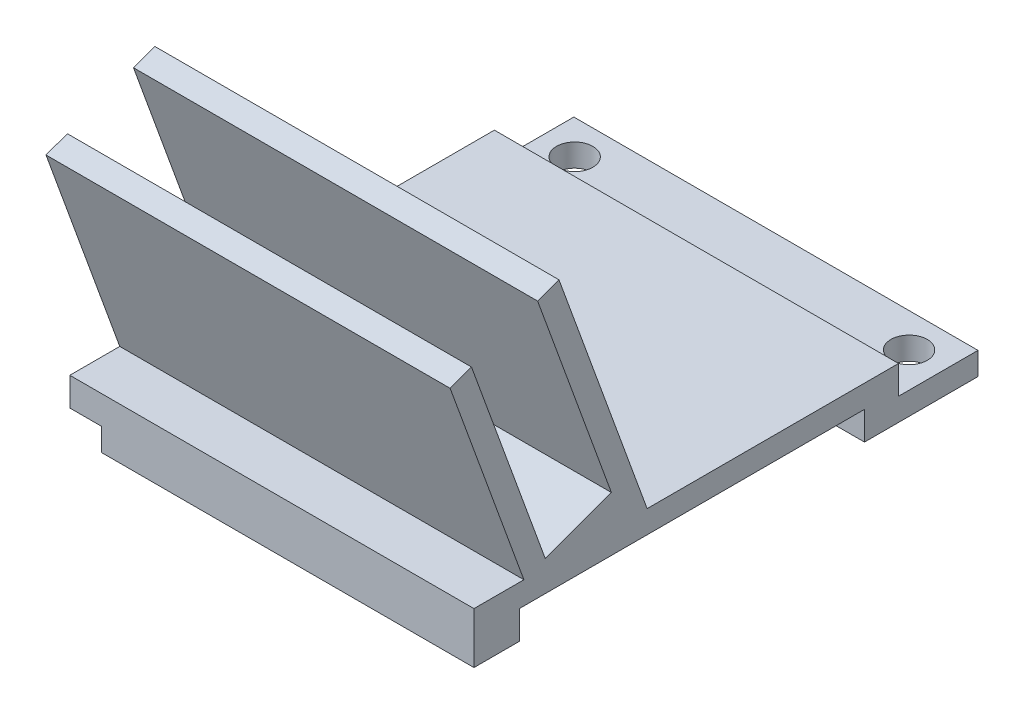
ISO-10303-21;
HEADER;
FILE_DESCRIPTION(('STEP AP214'),'2;1');
FILE_NAME('part.step','',(''),(''),'','','');
FILE_SCHEMA(('AUTOMOTIVE_DESIGN { 1 0 10303 214 1 1 1 1 }'));
ENDSEC;
DATA;
#1=APPLICATION_CONTEXT('core data for automotive mechanical design processes');
#2=APPLICATION_PROTOCOL_DEFINITION('international standard','automotive_design',2000,#1);
#3=PRODUCT_CONTEXT('',#1,'mechanical');
#4=PRODUCT('Part','Part','',(#3));
#5=PRODUCT_RELATED_PRODUCT_CATEGORY('part','',(#4));
#6=PRODUCT_DEFINITION_FORMATION('','',#4);
#7=PRODUCT_DEFINITION_CONTEXT('part definition',#1,'design');
#8=PRODUCT_DEFINITION('design','',#6,#7);
#9=PRODUCT_DEFINITION_SHAPE('','',#8);
#10=(LENGTH_UNIT() NAMED_UNIT(*) SI_UNIT(.MILLI.,.METRE.));
#11=(NAMED_UNIT(*) PLANE_ANGLE_UNIT() SI_UNIT($,.RADIAN.));
#12=(NAMED_UNIT(*) SI_UNIT($,.STERADIAN.) SOLID_ANGLE_UNIT());
#13=UNCERTAINTY_MEASURE_WITH_UNIT(LENGTH_MEASURE(1.E-05),#10,'distance_accuracy_value','');
#14=(GEOMETRIC_REPRESENTATION_CONTEXT(3) GLOBAL_UNCERTAINTY_ASSIGNED_CONTEXT((#13)) GLOBAL_UNIT_ASSIGNED_CONTEXT((#10,
#11,#12)) REPRESENTATION_CONTEXT('',''));
#15=CARTESIAN_POINT('',(0.,0.,0.));
#16=DIRECTION('',(0.,0.,1.));
#17=DIRECTION('',(1.,0.,0.));
#18=AXIS2_PLACEMENT_3D('',#15,#16,#17);
#19=CARTESIAN_POINT('',(17.8,2.,-3.));
#20=DIRECTION('',(-1.,0.,0.));
#21=DIRECTION('',(0.,0.,1.));
#22=AXIS2_PLACEMENT_3D('',#19,#20,#21);
#23=PLANE('',#22);
#24=DIRECTION('',(0.,1.,0.));
#25=VECTOR('',#24,1.);
#26=CARTESIAN_POINT('',(17.8,2.,37.4));
#27=LINE('',#26,#25);
#28=CARTESIAN_POINT('',(17.8,0.,37.4));
#29=VERTEX_POINT('',#28);
#30=CARTESIAN_POINT('',(17.8,2.5,37.4));
#31=VERTEX_POINT('',#30);
#32=EDGE_CURVE('E273',#29,#31,#27,.T.);
#33=ORIENTED_EDGE('',*,*,#32,.T.);
#34=DIRECTION('',(0.,0.,-1.));
#35=VECTOR('',#34,1.);
#36=CARTESIAN_POINT('',(17.8,2.5,37.));
#37=LINE('',#36,#35);
#38=CARTESIAN_POINT('',(17.8,2.5,7.));
#39=VERTEX_POINT('',#38);
#40=EDGE_CURVE('E291',#31,#39,#37,.T.);
#41=ORIENTED_EDGE('',*,*,#40,.T.);
#42=DIRECTION('',(0.,-1.,0.));
#43=VECTOR('',#42,1.);
#44=CARTESIAN_POINT('',(17.8,2.,7.));
#45=LINE('',#44,#43);
#46=CARTESIAN_POINT('',(17.8,0.,7.));
#47=VERTEX_POINT('',#46);
#48=EDGE_CURVE('E289',#39,#47,#45,.T.);
#49=ORIENTED_EDGE('',*,*,#48,.T.);
#50=DIRECTION('',(0.,0.,-1.));
#51=VECTOR('',#50,1.);
#52=CARTESIAN_POINT('',(17.8,0.,-3.));
#53=LINE('',#52,#51);
#54=CARTESIAN_POINT('',(17.8,0.,-3.));
#55=VERTEX_POINT('',#54);
#56=EDGE_CURVE('E247',#47,#55,#53,.T.);
#57=ORIENTED_EDGE('',*,*,#56,.T.);
#58=DIRECTION('',(0.,-1.,0.));
#59=VECTOR('',#58,1.);
#60=CARTESIAN_POINT('',(17.8,2.,-3.));
#61=LINE('',#60,#59);
#62=CARTESIAN_POINT('',(17.8,2.,-3.));
#63=VERTEX_POINT('',#62);
#64=EDGE_CURVE('E279',#63,#55,#61,.T.);
#65=ORIENTED_EDGE('',*,*,#64,.F.);
#66=DIRECTION('',(0.,0.,-1.));
#67=VECTOR('',#66,1.);
#68=CARTESIAN_POINT('',(17.8,2.,3.));
#69=LINE('',#68,#67);
#70=CARTESIAN_POINT('',(17.8,2.,4.));
#71=VERTEX_POINT('',#70);
#72=EDGE_CURVE('E194',#71,#63,#69,.T.);
#73=ORIENTED_EDGE('',*,*,#72,.F.);
#74=DIRECTION('',(0.,-1.,0.));
#75=VECTOR('',#74,1.);
#76=CARTESIAN_POINT('',(17.8,4.5,4.));
#77=LINE('',#76,#75);
#78=CARTESIAN_POINT('',(17.8,4.5,4.));
#79=VERTEX_POINT('',#78);
#80=EDGE_CURVE('E203',#79,#71,#77,.T.);
#81=ORIENTED_EDGE('',*,*,#80,.F.);
#82=DIRECTION('',(0.,0.,-1.));
#83=VECTOR('',#82,1.);
#84=CARTESIAN_POINT('',(17.8,4.5,7.));
#85=LINE('',#84,#83);
#86=CARTESIAN_POINT('',(17.8,4.5,26.1453867207457));
#87=VERTEX_POINT('',#86);
#88=EDGE_CURVE('E301',#87,#79,#85,.T.);
#89=ORIENTED_EDGE('',*,*,#88,.F.);
#90=DIRECTION('',(0.,0.93969262078591,0.342020143325664));
#91=VECTOR('',#90,1.);
#92=CARTESIAN_POINT('',(17.8,7.98860546192176,27.4151352679837));
#93=LINE('',#92,#91);
#94=CARTESIAN_POINT('',(17.8,25.8427652568541,33.9135179911713));
#95=VERTEX_POINT('',#94);
#96=EDGE_CURVE('E89',#87,#95,#93,.T.);
#97=ORIENTED_EDGE('',*,*,#96,.T.);
#98=DIRECTION('',(0.,-0.34202014332566,0.939692620785912));
#99=VECTOR('',#98,1.);
#100=CARTESIAN_POINT('',(17.8,25.1587249702027,35.7929032327431));
#101=LINE('',#100,#99);
#102=CARTESIAN_POINT('',(17.8,25.1587249702027,35.7929032327431));
#103=VERTEX_POINT('',#102);
#104=EDGE_CURVE('E36',#95,#103,#101,.T.);
#105=ORIENTED_EDGE('',*,*,#104,.T.);
#106=DIRECTION('',(0.,-0.93969262078591,-0.342020143325664));
#107=VECTOR('',#106,1.);
#108=CARTESIAN_POINT('',(17.8,7.30456517527043,29.2945205095555));
#109=LINE('',#108,#107);
#110=CARTESIAN_POINT('',(17.8,7.30456517527043,29.2945205095555));
#111=VERTEX_POINT('',#110);
#112=EDGE_CURVE('E115',#103,#111,#109,.T.);
#113=ORIENTED_EDGE('',*,*,#112,.T.);
#114=DIRECTION('',(0.,-0.342020143325663,0.939692620785911));
#115=VECTOR('',#114,1.);
#116=CARTESIAN_POINT('',(17.8,7.30456517527043,29.2945205095555));
#117=LINE('',#116,#115);
#118=CARTESIAN_POINT('',(17.8,5.18404028665133,35.1206147584282));
#119=VERTEX_POINT('',#118);
#120=EDGE_CURVE('E119',#111,#119,#117,.T.);
#121=ORIENTED_EDGE('',*,*,#120,.T.);
#122=DIRECTION('',(0.,0.939692620785911,0.342020143325663));
#123=VECTOR('',#122,1.);
#124=CARTESIAN_POINT('',(17.8,5.18404028665133,35.1206147584282));
#125=LINE('',#124,#123);
#126=CARTESIAN_POINT('',(17.8,23.0382000815836,41.6189974816158));
#127=VERTEX_POINT('',#126);
#128=EDGE_CURVE('E250',#119,#127,#125,.T.);
#129=ORIENTED_EDGE('',*,*,#128,.T.);
#130=DIRECTION('',(0.,-0.342020143325664,0.93969262078591));
#131=VECTOR('',#130,1.);
#132=CARTESIAN_POINT('',(17.8,23.0382000815836,41.6189974816158));
#133=LINE('',#132,#131);
#134=CARTESIAN_POINT('',(17.8,22.3541597949323,43.4983827231876));
#135=VERTEX_POINT('',#134);
#136=EDGE_CURVE('E252',#127,#135,#133,.T.);
#137=ORIENTED_EDGE('',*,*,#136,.T.);
#138=DIRECTION('',(0.,-0.939692620785911,-0.342020143325663));
#139=VECTOR('',#138,1.);
#140=CARTESIAN_POINT('',(17.8,4.5,37.));
#141=LINE('',#140,#139);
#142=CARTESIAN_POINT('',(17.8,4.5,37.));
#143=VERTEX_POINT('',#142);
#144=EDGE_CURVE('E254',#135,#143,#141,.T.);
#145=ORIENTED_EDGE('',*,*,#144,.T.);
#146=DIRECTION('',(0.,0.,1.));
#147=VECTOR('',#146,1.);
#148=CARTESIAN_POINT('',(17.8,4.5,37.));
#149=LINE('',#148,#147);
#150=CARTESIAN_POINT('',(17.8,4.5,41.4));
#151=VERTEX_POINT('',#150);
#152=EDGE_CURVE('E256',#143,#151,#149,.T.);
#153=ORIENTED_EDGE('',*,*,#152,.T.);
#154=DIRECTION('',(0.,1.,0.));
#155=VECTOR('',#154,1.);
#156=CARTESIAN_POINT('',(17.8,0.,41.4));
#157=LINE('',#156,#155);
#158=CARTESIAN_POINT('',(17.8,0.,41.4));
#159=VERTEX_POINT('',#158);
#160=EDGE_CURVE('E318',#159,#151,#157,.T.);
#161=ORIENTED_EDGE('',*,*,#160,.F.);
#162=DIRECTION('',(0.,0.,-1.));
#163=VECTOR('',#162,1.);
#164=CARTESIAN_POINT('',(17.8,0.,37.));
#165=LINE('',#164,#163);
#166=EDGE_CURVE('E309',#159,#29,#165,.T.);
#167=ORIENTED_EDGE('',*,*,#166,.T.);
#168=EDGE_LOOP('',(#33,#41,#49,#57,#65,#73,#81,#89,#97,#105,#113,#121,#129,#137,#145,#153,#161,#167));
#169=FACE_BOUND('',#168,.T.);
#170=ADVANCED_FACE('F33',(#169),#23,.F.);
#171=CARTESIAN_POINT('',(-17.8,2.,3.));
#172=DIRECTION('',(1.,0.,0.));
#173=DIRECTION('',(0.,0.,-1.));
#174=AXIS2_PLACEMENT_3D('',#171,#172,#173);
#175=PLANE('',#174);
#176=DIRECTION('',(0.,0.,1.));
#177=VECTOR('',#176,1.);
#178=CARTESIAN_POINT('',(-17.8,0.,37.));
#179=LINE('',#178,#177);
#180=CARTESIAN_POINT('',(-17.8,0.,31.4));
#181=VERTEX_POINT('',#180);
#182=CARTESIAN_POINT('',(-17.8,0.,38.6));
#183=VERTEX_POINT('',#182);
#184=EDGE_CURVE('E238',#181,#183,#179,.T.);
#185=ORIENTED_EDGE('',*,*,#184,.T.);
#186=DIRECTION('',(0.,-1.,0.));
#187=VECTOR('',#186,1.);
#188=CARTESIAN_POINT('',(-17.8,2.,38.6));
#189=LINE('',#188,#187);
#190=CARTESIAN_POINT('',(-17.8,2.,38.6));
#191=VERTEX_POINT('',#190);
#192=EDGE_CURVE('E577',#191,#183,#189,.T.);
#193=ORIENTED_EDGE('',*,*,#192,.F.);
#194=DIRECTION('',(0.,0.,-1.));
#195=VECTOR('',#194,1.);
#196=CARTESIAN_POINT('',(-17.8,2.,41.4));
#197=LINE('',#196,#195);
#198=CARTESIAN_POINT('',(-17.8,2.,41.4));
#199=VERTEX_POINT('',#198);
#200=EDGE_CURVE('E580',#199,#191,#197,.T.);
#201=ORIENTED_EDGE('',*,*,#200,.F.);
#202=DIRECTION('',(0.,-1.,0.));
#203=VECTOR('',#202,1.);
#204=CARTESIAN_POINT('',(-17.8,24.5,41.4));
#205=LINE('',#204,#203);
#206=CARTESIAN_POINT('',(-17.8,4.5,41.4));
#207=VERTEX_POINT('',#206);
#208=EDGE_CURVE('E282',#207,#199,#205,.T.);
#209=ORIENTED_EDGE('',*,*,#208,.F.);
#210=DIRECTION('',(0.,0.,1.));
#211=VECTOR('',#210,1.);
#212=CARTESIAN_POINT('',(-17.8,4.5,37.));
#213=LINE('',#212,#211);
#214=CARTESIAN_POINT('',(-17.8,4.5,37.));
#215=VERTEX_POINT('',#214);
#216=EDGE_CURVE('E344',#215,#207,#213,.T.);
#217=ORIENTED_EDGE('',*,*,#216,.F.);
#218=DIRECTION('',(0.,0.939692620785911,0.342020143325663));
#219=VECTOR('',#218,1.);
#220=CARTESIAN_POINT('',(-17.8,4.5,37.));
#221=LINE('',#220,#219);
#222=CARTESIAN_POINT('',(-17.8,22.3541597949323,43.4983827231876));
#223=VERTEX_POINT('',#222);
#224=EDGE_CURVE('E235',#215,#223,#221,.T.);
#225=ORIENTED_EDGE('',*,*,#224,.T.);
#226=DIRECTION('',(0.,0.342020143325664,-0.93969262078591));
#227=VECTOR('',#226,1.);
#228=CARTESIAN_POINT('',(-17.8,23.0382000815836,41.6189974816158));
#229=LINE('',#228,#227);
#230=CARTESIAN_POINT('',(-17.8,23.0382000815836,41.6189974816158));
#231=VERTEX_POINT('',#230);
#232=EDGE_CURVE('E233',#223,#231,#229,.T.);
#233=ORIENTED_EDGE('',*,*,#232,.T.);
#234=DIRECTION('',(0.,-0.939692620785911,-0.342020143325663));
#235=VECTOR('',#234,1.);
#236=CARTESIAN_POINT('',(-17.8,5.18404028665133,35.1206147584282));
#237=LINE('',#236,#235);
#238=CARTESIAN_POINT('',(-17.8,5.18404028665132,35.1206147584282));
#239=VERTEX_POINT('',#238);
#240=EDGE_CURVE('E230',#231,#239,#237,.T.);
#241=ORIENTED_EDGE('',*,*,#240,.T.);
#242=DIRECTION('',(0.,0.342020143325663,-0.939692620785911));
#243=VECTOR('',#242,1.);
#244=CARTESIAN_POINT('',(-17.8,7.30456517527043,29.2945205095555));
#245=LINE('',#244,#243);
#246=CARTESIAN_POINT('',(-17.8,7.30456517527043,29.2945205095555));
#247=VERTEX_POINT('',#246);
#248=EDGE_CURVE('E79',#239,#247,#245,.T.);
#249=ORIENTED_EDGE('',*,*,#248,.T.);
#250=DIRECTION('',(0.,0.93969262078591,0.342020143325664));
#251=VECTOR('',#250,1.);
#252=CARTESIAN_POINT('',(-17.8,7.30456517527043,29.2945205095555));
#253=LINE('',#252,#251);
#254=CARTESIAN_POINT('',(-17.8,25.1587249702027,35.7929032327431));
#255=VERTEX_POINT('',#254);
#256=EDGE_CURVE('E242',#247,#255,#253,.T.);
#257=ORIENTED_EDGE('',*,*,#256,.T.);
#258=DIRECTION('',(0.,0.34202014332566,-0.939692620785911));
#259=VECTOR('',#258,1.);
#260=CARTESIAN_POINT('',(-17.8,25.1587249702027,35.7929032327431));
#261=LINE('',#260,#259);
#262=CARTESIAN_POINT('',(-17.8,25.8427652568541,33.9135179911713));
#263=VERTEX_POINT('',#262);
#264=EDGE_CURVE('E232',#255,#263,#261,.T.);
#265=ORIENTED_EDGE('',*,*,#264,.T.);
#266=DIRECTION('',(0.,-0.93969262078591,-0.342020143325664));
#267=VECTOR('',#266,1.);
#268=CARTESIAN_POINT('',(-17.8,7.98860546192176,27.4151352679837));
#269=LINE('',#268,#267);
#270=CARTESIAN_POINT('',(-17.8,4.5,26.1453867207457));
#271=VERTEX_POINT('',#270);
#272=EDGE_CURVE('E239',#263,#271,#269,.T.);
#273=ORIENTED_EDGE('',*,*,#272,.T.);
#274=DIRECTION('',(0.,0.,1.));
#275=VECTOR('',#274,1.);
#276=CARTESIAN_POINT('',(-17.8,4.5,7.));
#277=LINE('',#276,#275);
#278=CARTESIAN_POINT('',(-17.8,4.5,4.));
#279=VERTEX_POINT('',#278);
#280=EDGE_CURVE('E209',#279,#271,#277,.T.);
#281=ORIENTED_EDGE('',*,*,#280,.F.);
#282=DIRECTION('',(0.,1.,0.));
#283=VECTOR('',#282,1.);
#284=CARTESIAN_POINT('',(-17.8,2.,4.));
#285=LINE('',#284,#283);
#286=CARTESIAN_POINT('',(-17.8,2.,4.));
#287=VERTEX_POINT('',#286);
#288=EDGE_CURVE('E200',#287,#279,#285,.T.);
#289=ORIENTED_EDGE('',*,*,#288,.F.);
#290=DIRECTION('',(0.,0.,1.));
#291=VECTOR('',#290,1.);
#292=CARTESIAN_POINT('',(-17.8,2.,-3.));
#293=LINE('',#292,#291);
#294=CARTESIAN_POINT('',(-17.8,2.,-3.));
#295=VERTEX_POINT('',#294);
#296=EDGE_CURVE('E184',#295,#287,#293,.T.);
#297=ORIENTED_EDGE('',*,*,#296,.F.);
#298=DIRECTION('',(0.,-1.,0.));
#299=VECTOR('',#298,1.);
#300=CARTESIAN_POINT('',(-17.8,2.,-3.));
#301=LINE('',#300,#299);
#302=CARTESIAN_POINT('',(-17.8,0.,-3.));
#303=VERTEX_POINT('',#302);
#304=EDGE_CURVE('E241',#295,#303,#301,.T.);
#305=ORIENTED_EDGE('',*,*,#304,.T.);
#306=DIRECTION('',(0.,0.,1.));
#307=VECTOR('',#306,1.);
#308=CARTESIAN_POINT('',(-17.8,0.,3.));
#309=LINE('',#308,#307);
#310=CARTESIAN_POINT('',(-17.8,0.,7.));
#311=VERTEX_POINT('',#310);
#312=EDGE_CURVE('E285',#303,#311,#309,.T.);
#313=ORIENTED_EDGE('',*,*,#312,.T.);
#314=DIRECTION('',(0.,-1.,0.));
#315=VECTOR('',#314,1.);
#316=CARTESIAN_POINT('',(-17.8,2.,7.));
#317=LINE('',#316,#315);
#318=CARTESIAN_POINT('',(-17.8,2.5,7.));
#319=VERTEX_POINT('',#318);
#320=EDGE_CURVE('E286',#319,#311,#317,.T.);
#321=ORIENTED_EDGE('',*,*,#320,.F.);
#322=DIRECTION('',(0.,0.,-1.));
#323=VECTOR('',#322,1.);
#324=CARTESIAN_POINT('',(-17.8,2.5,37.));
#325=LINE('',#324,#323);
#326=CARTESIAN_POINT('',(-17.8,2.5,31.4));
#327=VERTEX_POINT('',#326);
#328=EDGE_CURVE('E305',#327,#319,#325,.T.);
#329=ORIENTED_EDGE('',*,*,#328,.F.);
#330=DIRECTION('',(0.,1.,0.));
#331=VECTOR('',#330,1.);
#332=CARTESIAN_POINT('',(-17.8,0.,31.4));
#333=LINE('',#332,#331);
#334=EDGE_CURVE('E335',#181,#327,#333,.T.);
#335=ORIENTED_EDGE('',*,*,#334,.F.);
#336=EDGE_LOOP('',(#185,#193,#201,#209,#217,#225,#233,#241,#249,#257,#265,#273,#281,#289,#297,
#305,#313,#321,#329,#335));
#337=FACE_BOUND('',#336,.T.);
#338=ADVANCED_FACE('F207',(#337),#175,.F.);
#339=CARTESIAN_POINT('',(45.307091795934,7.98860546192176,27.4151352679837));
#340=DIRECTION('',(0.,0.342020143325664,-0.93969262078591));
#341=DIRECTION('',(0.,0.93969262078591,0.342020143325664));
#342=AXIS2_PLACEMENT_3D('',#339,#340,#341);
#343=PLANE('',#342);
#344=DIRECTION('',(-1.,0.,0.));
#345=VECTOR('',#344,1.);
#346=CARTESIAN_POINT('',(45.307091795934,25.8427652568541,33.9135179911713));
#347=LINE('',#346,#345);
#348=EDGE_CURVE('E212',#95,#263,#347,.T.);
#349=ORIENTED_EDGE('',*,*,#348,.F.);
#350=ORIENTED_EDGE('',*,*,#96,.F.);
#351=DIRECTION('',(-1.,0.,0.));
#352=VECTOR('',#351,1.);
#353=CARTESIAN_POINT('',(45.307091795934,4.5,26.1453867207457));
#354=LINE('',#353,#352);
#355=EDGE_CURVE('E11',#87,#271,#354,.T.);
#356=ORIENTED_EDGE('',*,*,#355,.T.);
#357=ORIENTED_EDGE('',*,*,#272,.F.);
#358=EDGE_LOOP('',(#349,#350,#356,#357));
#359=FACE_BOUND('',#358,.T.);
#360=ADVANCED_FACE('F384',(#359),#343,.T.);
#361=CARTESIAN_POINT('',(0.,4.5,0.));
#362=DIRECTION('',(0.,-1.,0.));
#363=DIRECTION('',(0.,0.,-1.));
#364=AXIS2_PLACEMENT_3D('',#361,#362,#363);
#365=PLANE('',#364);
#366=ORIENTED_EDGE('',*,*,#280,.T.);
#367=ORIENTED_EDGE('',*,*,#355,.F.);
#368=ORIENTED_EDGE('',*,*,#88,.T.);
#369=DIRECTION('',(1.,0.,0.));
#370=VECTOR('',#369,1.);
#371=CARTESIAN_POINT('',(-17.8,4.5,4.));
#372=LINE('',#371,#370);
#373=EDGE_CURVE('E210',#279,#79,#372,.T.);
#374=ORIENTED_EDGE('',*,*,#373,.F.);
#375=EDGE_LOOP('',(#366,#367,#368,#374));
#376=FACE_BOUND('',#375,.T.);
#377=ADVANCED_FACE('F383',(#376),#365,.F.);
#378=CARTESIAN_POINT('',(-14.8,-10.4403065089106,37.));
#379=DIRECTION('',(-1.,0.,0.));
#380=DIRECTION('',(0.,0.,1.));
#381=AXIS2_PLACEMENT_3D('',#378,#379,#380);
#382=PLANE('',#381);
#383=DIRECTION('',(0.,-1.,0.));
#384=VECTOR('',#383,1.);
#385=CARTESIAN_POINT('',(-14.8,2.5,31.4));
#386=LINE('',#385,#384);
#387=CARTESIAN_POINT('',(-14.8,2.5,31.4));
#388=VERTEX_POINT('',#387);
#389=CARTESIAN_POINT('',(-14.8,0.,31.4));
#390=VERTEX_POINT('',#389);
#391=EDGE_CURVE('E341',#388,#390,#386,.T.);
#392=ORIENTED_EDGE('',*,*,#391,.F.);
#393=DIRECTION('',(0.,0.,1.));
#394=VECTOR('',#393,1.);
#395=CARTESIAN_POINT('',(-14.8,2.5,37.));
#396=LINE('',#395,#394);
#397=CARTESIAN_POINT('',(-14.8,2.5,37.4));
#398=VERTEX_POINT('',#397);
#399=EDGE_CURVE('E303',#388,#398,#396,.T.);
#400=ORIENTED_EDGE('',*,*,#399,.T.);
#401=DIRECTION('',(0.,1.,0.));
#402=VECTOR('',#401,1.);
#403=CARTESIAN_POINT('',(-14.8,0.,37.4));
#404=LINE('',#403,#402);
#405=CARTESIAN_POINT('',(-14.8,0.,37.4));
#406=VERTEX_POINT('',#405);
#407=EDGE_CURVE('E326',#406,#398,#404,.T.);
#408=ORIENTED_EDGE('',*,*,#407,.F.);
#409=DIRECTION('',(0.,0.,-1.));
#410=VECTOR('',#409,1.);
#411=CARTESIAN_POINT('',(-14.8,0.,37.));
#412=LINE('',#411,#410);
#413=EDGE_CURVE('E307',#406,#390,#412,.T.);
#414=ORIENTED_EDGE('',*,*,#413,.T.);
#415=EDGE_LOOP('',(#392,#400,#408,#414));
#416=FACE_BOUND('',#415,.T.);
#417=ADVANCED_FACE('F392',(#416),#382,.F.);
#418=CARTESIAN_POINT('',(0.,0.,0.));
#419=DIRECTION('',(0.,1.,0.));
#420=DIRECTION('',(0.,0.,1.));
#421=AXIS2_PLACEMENT_3D('',#418,#419,#420);
#422=PLANE('',#421);
#423=DIRECTION('',(1.,0.,0.));
#424=VECTOR('',#423,1.);
#425=CARTESIAN_POINT('',(-17.8,0.,41.4));
#426=LINE('',#425,#424);
#427=CARTESIAN_POINT('',(-15.,0.,41.4));
#428=VERTEX_POINT('',#427);
#429=EDGE_CURVE('E322',#428,#159,#426,.T.);
#430=ORIENTED_EDGE('',*,*,#429,.F.);
#431=DIRECTION('',(0.,0.,1.));
#432=VECTOR('',#431,1.);
#433=CARTESIAN_POINT('',(-15.,0.,41.4));
#434=LINE('',#433,#432);
#435=CARTESIAN_POINT('',(-15.,0.,38.6));
#436=VERTEX_POINT('',#435);
#437=EDGE_CURVE('E584',#436,#428,#434,.T.);
#438=ORIENTED_EDGE('',*,*,#437,.F.);
#439=DIRECTION('',(1.,0.,0.));
#440=VECTOR('',#439,1.);
#441=CARTESIAN_POINT('',(-17.8,0.,38.6));
#442=LINE('',#441,#440);
#443=EDGE_CURVE('E593',#183,#436,#442,.T.);
#444=ORIENTED_EDGE('',*,*,#443,.F.);
#445=ORIENTED_EDGE('',*,*,#184,.F.);
#446=DIRECTION('',(-1.,0.,0.));
#447=VECTOR('',#446,1.);
#448=CARTESIAN_POINT('',(-14.8,0.,31.4));
#449=LINE('',#448,#447);
#450=EDGE_CURVE('E339',#390,#181,#449,.T.);
#451=ORIENTED_EDGE('',*,*,#450,.F.);
#452=ORIENTED_EDGE('',*,*,#413,.F.);
#453=DIRECTION('',(-1.,0.,0.));
#454=VECTOR('',#453,1.);
#455=CARTESIAN_POINT('',(14.8,0.,37.4));
#456=LINE('',#455,#454);
#457=EDGE_CURVE('E330',#29,#406,#456,.T.);
#458=ORIENTED_EDGE('',*,*,#457,.F.);
#459=ORIENTED_EDGE('',*,*,#166,.F.);
#460=EDGE_LOOP('',(#430,#438,#444,#445,#451,#452,#458,#459));
#461=FACE_BOUND('',#460,.T.);
#462=ADVANCED_FACE('F415',(#461),#422,.F.);
#463=CARTESIAN_POINT('',(-17.8,2.5,37.));
#464=DIRECTION('',(0.,1.,0.));
#465=DIRECTION('',(0.,0.,1.));
#466=AXIS2_PLACEMENT_3D('',#463,#464,#465);
#467=PLANE('',#466);
#468=ORIENTED_EDGE('',*,*,#399,.F.);
#469=DIRECTION('',(1.,0.,0.));
#470=VECTOR('',#469,1.);
#471=CARTESIAN_POINT('',(-17.8,2.5,31.4));
#472=LINE('',#471,#470);
#473=EDGE_CURVE('E329',#327,#388,#472,.T.);
#474=ORIENTED_EDGE('',*,*,#473,.F.);
#475=ORIENTED_EDGE('',*,*,#328,.T.);
#476=DIRECTION('',(1.,0.,0.));
#477=VECTOR('',#476,1.);
#478=CARTESIAN_POINT('',(-17.8,2.5,7.));
#479=LINE('',#478,#477);
#480=EDGE_CURVE('E288',#319,#39,#479,.T.);
#481=ORIENTED_EDGE('',*,*,#480,.T.);
#482=ORIENTED_EDGE('',*,*,#40,.F.);
#483=DIRECTION('',(1.,0.,0.));
#484=VECTOR('',#483,1.);
#485=CARTESIAN_POINT('',(-14.8,2.5,37.4));
#486=LINE('',#485,#484);
#487=EDGE_CURVE('E321',#398,#31,#486,.T.);
#488=ORIENTED_EDGE('',*,*,#487,.F.);
#489=EDGE_LOOP('',(#468,#474,#475,#481,#482,#488));
#490=FACE_BOUND('',#489,.T.);
#491=ADVANCED_FACE('F410',(#490),#467,.F.);
#492=CARTESIAN_POINT('',(-17.8,2.,7.));
#493=DIRECTION('',(0.,0.,-1.));
#494=DIRECTION('',(-1.,0.,0.));
#495=AXIS2_PLACEMENT_3D('',#492,#493,#494);
#496=PLANE('',#495);
#497=ORIENTED_EDGE('',*,*,#480,.F.);
#498=ORIENTED_EDGE('',*,*,#320,.T.);
#499=DIRECTION('',(1.,0.,0.));
#500=VECTOR('',#499,1.);
#501=CARTESIAN_POINT('',(-17.8,0.,7.));
#502=LINE('',#501,#500);
#503=EDGE_CURVE('E195',#311,#47,#502,.T.);
#504=ORIENTED_EDGE('',*,*,#503,.T.);
#505=ORIENTED_EDGE('',*,*,#48,.F.);
#506=EDGE_LOOP('',(#497,#498,#504,#505));
#507=FACE_BOUND('',#506,.T.);
#508=ADVANCED_FACE('F378',(#507),#496,.F.);
#509=CARTESIAN_POINT('',(0.,2.,0.));
#510=DIRECTION('',(0.,1.,0.));
#511=DIRECTION('',(0.,0.,1.));
#512=AXIS2_PLACEMENT_3D('',#509,#510,#511);
#513=PLANE('',#512);
#514=CARTESIAN_POINT('',(-14.73,2.,0.));
#515=DIRECTION('',(0.,1.,0.));
#516=DIRECTION('',(0.,0.,1.));
#517=AXIS2_PLACEMENT_3D('',#514,#515,#516);
#518=CIRCLE('',#517,1.6);
#519=CARTESIAN_POINT('',(-14.73,2.,1.6));
#520=VERTEX_POINT('',#519);
#521=EDGE_CURVE('E352',#520,#520,#518,.T.);
#522=ORIENTED_EDGE('',*,*,#521,.F.);
#523=EDGE_LOOP('',(#522));
#524=FACE_BOUND('',#523,.T.);
#525=CARTESIAN_POINT('',(14.73,2.,0.));
#526=DIRECTION('',(0.,1.,0.));
#527=DIRECTION('',(0.,0.,1.));
#528=AXIS2_PLACEMENT_3D('',#525,#526,#527);
#529=CIRCLE('',#528,1.6);
#530=CARTESIAN_POINT('',(14.73,2.,1.6));
#531=VERTEX_POINT('',#530);
#532=EDGE_CURVE('E346',#531,#531,#529,.T.);
#533=ORIENTED_EDGE('',*,*,#532,.F.);
#534=EDGE_LOOP('',(#533));
#535=FACE_BOUND('',#534,.T.);
#536=ORIENTED_EDGE('',*,*,#296,.T.);
#537=DIRECTION('',(-1.,0.,0.));
#538=VECTOR('',#537,1.);
#539=CARTESIAN_POINT('',(17.8,2.,4.));
#540=LINE('',#539,#538);
#541=EDGE_CURVE('E187',#71,#287,#540,.T.);
#542=ORIENTED_EDGE('',*,*,#541,.F.);
#543=ORIENTED_EDGE('',*,*,#72,.T.);
#544=DIRECTION('',(-1.,0.,0.));
#545=VECTOR('',#544,1.);
#546=CARTESIAN_POINT('',(-17.8,2.,-3.));
#547=LINE('',#546,#545);
#548=EDGE_CURVE('E190',#63,#295,#547,.T.);
#549=ORIENTED_EDGE('',*,*,#548,.T.);
#550=EDGE_LOOP('',(#536,#542,#543,#549));
#551=FACE_BOUND('',#550,.T.);
#552=ADVANCED_FACE('F186',(#524,#535,#551),#513,.T.);
#553=CARTESIAN_POINT('',(0.,0.,0.));
#554=DIRECTION('',(0.,1.,0.));
#555=DIRECTION('',(0.,0.,1.));
#556=AXIS2_PLACEMENT_3D('',#553,#554,#555);
#557=PLANE('',#556);
#558=CARTESIAN_POINT('',(-14.73,0.,0.));
#559=DIRECTION('',(0.,-1.,0.));
#560=DIRECTION('',(0.,0.,-1.));
#561=AXIS2_PLACEMENT_3D('',#558,#559,#560);
#562=CIRCLE('',#561,1.6);
#563=CARTESIAN_POINT('',(-14.73,0.,-1.6));
#564=VERTEX_POINT('',#563);
#565=EDGE_CURVE('E217',#564,#564,#562,.T.);
#566=ORIENTED_EDGE('',*,*,#565,.F.);
#567=EDGE_LOOP('',(#566));
#568=FACE_BOUND('',#567,.T.);
#569=CARTESIAN_POINT('',(14.73,0.,0.));
#570=DIRECTION('',(0.,-1.,0.));
#571=DIRECTION('',(0.,0.,-1.));
#572=AXIS2_PLACEMENT_3D('',#569,#570,#571);
#573=CIRCLE('',#572,1.6);
#574=CARTESIAN_POINT('',(14.73,0.,-1.60000000000001));
#575=VERTEX_POINT('',#574);
#576=EDGE_CURVE('E355',#575,#575,#573,.T.);
#577=ORIENTED_EDGE('',*,*,#576,.F.);
#578=EDGE_LOOP('',(#577));
#579=FACE_BOUND('',#578,.T.);
#580=ORIENTED_EDGE('',*,*,#56,.F.);
#581=ORIENTED_EDGE('',*,*,#503,.F.);
#582=ORIENTED_EDGE('',*,*,#312,.F.);
#583=DIRECTION('',(-1.,0.,0.));
#584=VECTOR('',#583,1.);
#585=CARTESIAN_POINT('',(-17.8,0.,-3.));
#586=LINE('',#585,#584);
#587=EDGE_CURVE('E283',#55,#303,#586,.T.);
#588=ORIENTED_EDGE('',*,*,#587,.F.);
#589=EDGE_LOOP('',(#580,#581,#582,#588));
#590=FACE_BOUND('',#589,.T.);
#591=ADVANCED_FACE('F364',(#568,#579,#590),#557,.F.);
#592=CARTESIAN_POINT('',(-17.8,2.,-3.));
#593=DIRECTION('',(0.,0.,1.));
#594=DIRECTION('',(1.,0.,0.));
#595=AXIS2_PLACEMENT_3D('',#592,#593,#594);
#596=PLANE('',#595);
#597=ORIENTED_EDGE('',*,*,#587,.T.);
#598=ORIENTED_EDGE('',*,*,#304,.F.);
#599=ORIENTED_EDGE('',*,*,#548,.F.);
#600=ORIENTED_EDGE('',*,*,#64,.T.);
#601=EDGE_LOOP('',(#597,#598,#599,#600));
#602=FACE_BOUND('',#601,.T.);
#603=ADVANCED_FACE('F367',(#602),#596,.F.);
#604=CARTESIAN_POINT('',(0.,0.,41.4));
#605=DIRECTION('',(0.,0.,1.));
#606=DIRECTION('',(1.,0.,0.));
#607=AXIS2_PLACEMENT_3D('',#604,#605,#606);
#608=PLANE('',#607);
#609=DIRECTION('',(0.,-1.,0.));
#610=VECTOR('',#609,1.);
#611=CARTESIAN_POINT('',(-15.,2.,41.4));
#612=LINE('',#611,#610);
#613=CARTESIAN_POINT('',(-15.,2.,41.4));
#614=VERTEX_POINT('',#613);
#615=EDGE_CURVE('E275',#614,#428,#612,.T.);
#616=ORIENTED_EDGE('',*,*,#615,.T.);
#617=ORIENTED_EDGE('',*,*,#429,.T.);
#618=ORIENTED_EDGE('',*,*,#160,.T.);
#619=DIRECTION('',(1.,0.,0.));
#620=VECTOR('',#619,1.);
#621=CARTESIAN_POINT('',(-17.8,4.5,41.4));
#622=LINE('',#621,#620);
#623=EDGE_CURVE('E338',#207,#151,#622,.T.);
#624=ORIENTED_EDGE('',*,*,#623,.F.);
#625=ORIENTED_EDGE('',*,*,#208,.T.);
#626=DIRECTION('',(-1.,0.,0.));
#627=VECTOR('',#626,1.);
#628=CARTESIAN_POINT('',(-17.8,2.,41.4));
#629=LINE('',#628,#627);
#630=EDGE_CURVE('E583',#614,#199,#629,.T.);
#631=ORIENTED_EDGE('',*,*,#630,.F.);
#632=EDGE_LOOP('',(#616,#617,#618,#624,#625,#631));
#633=FACE_BOUND('',#632,.T.);
#634=ADVANCED_FACE('F427',(#633),#608,.T.);
#635=CARTESIAN_POINT('',(0.,0.,37.4));
#636=DIRECTION('',(0.,0.,-1.));
#637=DIRECTION('',(-1.,0.,0.));
#638=AXIS2_PLACEMENT_3D('',#635,#636,#637);
#639=PLANE('',#638);
#640=ORIENTED_EDGE('',*,*,#487,.T.);
#641=ORIENTED_EDGE('',*,*,#32,.F.);
#642=ORIENTED_EDGE('',*,*,#457,.T.);
#643=ORIENTED_EDGE('',*,*,#407,.T.);
#644=EDGE_LOOP('',(#640,#641,#642,#643));
#645=FACE_BOUND('',#644,.T.);
#646=ADVANCED_FACE('F424',(#645),#639,.T.);
#647=CARTESIAN_POINT('',(0.,0.,31.4));
#648=DIRECTION('',(0.,0.,-1.));
#649=DIRECTION('',(-1.,0.,0.));
#650=AXIS2_PLACEMENT_3D('',#647,#648,#649);
#651=PLANE('',#650);
#652=ORIENTED_EDGE('',*,*,#473,.T.);
#653=ORIENTED_EDGE('',*,*,#391,.T.);
#654=ORIENTED_EDGE('',*,*,#450,.T.);
#655=ORIENTED_EDGE('',*,*,#334,.T.);
#656=EDGE_LOOP('',(#652,#653,#654,#655));
#657=FACE_BOUND('',#656,.T.);
#658=ADVANCED_FACE('F426',(#657),#651,.T.);
#659=CARTESIAN_POINT('',(-17.8,4.5,37.));
#660=DIRECTION('',(0.,-1.,0.));
#661=DIRECTION('',(0.,0.,-1.));
#662=AXIS2_PLACEMENT_3D('',#659,#660,#661);
#663=PLANE('',#662);
#664=ORIENTED_EDGE('',*,*,#623,.T.);
#665=ORIENTED_EDGE('',*,*,#152,.F.);
#666=DIRECTION('',(1.,0.,0.));
#667=VECTOR('',#666,1.);
#668=CARTESIAN_POINT('',(-17.8,4.5,37.));
#669=LINE('',#668,#667);
#670=EDGE_CURVE('E228',#215,#143,#669,.T.);
#671=ORIENTED_EDGE('',*,*,#670,.F.);
#672=ORIENTED_EDGE('',*,*,#216,.T.);
#673=EDGE_LOOP('',(#664,#665,#671,#672));
#674=FACE_BOUND('',#673,.T.);
#675=ADVANCED_FACE('F498',(#674),#663,.F.);
#676=CARTESIAN_POINT('',(14.73,10.,0.));
#677=DIRECTION('',(0.,-1.,0.));
#678=DIRECTION('',(0.,0.,-1.));
#679=AXIS2_PLACEMENT_3D('',#676,#677,#678);
#680=CYLINDRICAL_SURFACE('',#679,1.6);
#681=ORIENTED_EDGE('',*,*,#532,.T.);
#682=EDGE_LOOP('',(#681));
#683=FACE_BOUND('',#682,.T.);
#684=ORIENTED_EDGE('',*,*,#576,.T.);
#685=EDGE_LOOP('',(#684));
#686=FACE_BOUND('',#685,.T.);
#687=ADVANCED_FACE('F502',(#683,#686),#680,.F.);
#688=CARTESIAN_POINT('',(-14.73,10.,0.));
#689=DIRECTION('',(0.,-1.,0.));
#690=DIRECTION('',(0.,0.,-1.));
#691=AXIS2_PLACEMENT_3D('',#688,#689,#690);
#692=CYLINDRICAL_SURFACE('',#691,1.6);
#693=ORIENTED_EDGE('',*,*,#521,.T.);
#694=EDGE_LOOP('',(#693));
#695=FACE_BOUND('',#694,.T.);
#696=ORIENTED_EDGE('',*,*,#565,.T.);
#697=EDGE_LOOP('',(#696));
#698=FACE_BOUND('',#697,.T.);
#699=ADVANCED_FACE('F362',(#695,#698),#692,.F.);
#700=CARTESIAN_POINT('',(0.,0.,4.));
#701=DIRECTION('',(0.,0.,-1.));
#702=DIRECTION('',(-1.,0.,0.));
#703=AXIS2_PLACEMENT_3D('',#700,#701,#702);
#704=PLANE('',#703);
#705=ORIENTED_EDGE('',*,*,#80,.T.);
#706=ORIENTED_EDGE('',*,*,#541,.T.);
#707=ORIENTED_EDGE('',*,*,#288,.T.);
#708=ORIENTED_EDGE('',*,*,#373,.T.);
#709=EDGE_LOOP('',(#705,#706,#707,#708));
#710=FACE_BOUND('',#709,.T.);
#711=ADVANCED_FACE('F198',(#710),#704,.T.);
#712=CARTESIAN_POINT('',(45.307091795934,25.1587249702027,35.7929032327431));
#713=DIRECTION('',(0.,0.939692620785912,0.34202014332566));
#714=DIRECTION('',(0.,-0.34202014332566,0.939692620785912));
#715=AXIS2_PLACEMENT_3D('',#712,#713,#714);
#716=PLANE('',#715);
#717=ORIENTED_EDGE('',*,*,#104,.F.);
#718=ORIENTED_EDGE('',*,*,#348,.T.);
#719=ORIENTED_EDGE('',*,*,#264,.F.);
#720=DIRECTION('',(-1.,0.,0.));
#721=VECTOR('',#720,1.);
#722=CARTESIAN_POINT('',(45.307091795934,25.1587249702027,35.7929032327431));
#723=LINE('',#722,#721);
#724=EDGE_CURVE('E222',#103,#255,#723,.T.);
#725=ORIENTED_EDGE('',*,*,#724,.F.);
#726=EDGE_LOOP('',(#717,#718,#719,#725));
#727=FACE_BOUND('',#726,.T.);
#728=ADVANCED_FACE('F262',(#727),#716,.T.);
#729=CARTESIAN_POINT('',(45.307091795934,7.30456517527043,29.2945205095555));
#730=DIRECTION('',(0.,-0.342020143325664,0.93969262078591));
#731=DIRECTION('',(0.,-0.93969262078591,-0.342020143325664));
#732=AXIS2_PLACEMENT_3D('',#729,#730,#731);
#733=PLANE('',#732);
#734=ORIENTED_EDGE('',*,*,#724,.T.);
#735=ORIENTED_EDGE('',*,*,#256,.F.);
#736=DIRECTION('',(-1.,0.,0.));
#737=VECTOR('',#736,1.);
#738=CARTESIAN_POINT('',(45.307091795934,7.30456517527043,29.2945205095555));
#739=LINE('',#738,#737);
#740=EDGE_CURVE('E219',#111,#247,#739,.T.);
#741=ORIENTED_EDGE('',*,*,#740,.F.);
#742=ORIENTED_EDGE('',*,*,#112,.F.);
#743=EDGE_LOOP('',(#734,#735,#741,#742));
#744=FACE_BOUND('',#743,.T.);
#745=ADVANCED_FACE('F265',(#744),#733,.T.);
#746=CARTESIAN_POINT('',(45.307091795934,7.30456517527043,29.2945205095555));
#747=DIRECTION('',(0.,0.93969262078591,0.342020143325663));
#748=DIRECTION('',(0.,-0.342020143325663,0.939692620785911));
#749=AXIS2_PLACEMENT_3D('',#746,#747,#748);
#750=PLANE('',#749);
#751=ORIENTED_EDGE('',*,*,#248,.F.);
#752=DIRECTION('',(-1.,0.,0.));
#753=VECTOR('',#752,1.);
#754=CARTESIAN_POINT('',(-17.8,5.18404028665133,35.1206147584282));
#755=LINE('',#754,#753);
#756=EDGE_CURVE('E249',#119,#239,#755,.T.);
#757=ORIENTED_EDGE('',*,*,#756,.F.);
#758=ORIENTED_EDGE('',*,*,#120,.F.);
#759=ORIENTED_EDGE('',*,*,#740,.T.);
#760=EDGE_LOOP('',(#751,#757,#758,#759));
#761=FACE_BOUND('',#760,.T.);
#762=ADVANCED_FACE('F268',(#761),#750,.T.);
#763=CARTESIAN_POINT('',(45.307091795934,4.5,37.));
#764=DIRECTION('',(0.,-0.342020143325663,0.93969262078591));
#765=DIRECTION('',(0.,-0.939692620785911,-0.342020143325663));
#766=AXIS2_PLACEMENT_3D('',#763,#764,#765);
#767=PLANE('',#766);
#768=ORIENTED_EDGE('',*,*,#144,.F.);
#769=DIRECTION('',(-1.,0.,0.));
#770=VECTOR('',#769,1.);
#771=CARTESIAN_POINT('',(45.307091795934,22.3541597949323,43.4983827231876));
#772=LINE('',#771,#770);
#773=EDGE_CURVE('E221',#135,#223,#772,.T.);
#774=ORIENTED_EDGE('',*,*,#773,.T.);
#775=ORIENTED_EDGE('',*,*,#224,.F.);
#776=ORIENTED_EDGE('',*,*,#670,.T.);
#777=EDGE_LOOP('',(#768,#774,#775,#776));
#778=FACE_BOUND('',#777,.T.);
#779=ADVANCED_FACE('F514',(#778),#767,.T.);
#780=CARTESIAN_POINT('',(45.307091795934,23.0382000815836,41.6189974816158));
#781=DIRECTION('',(0.,0.93969262078591,0.342020143325664));
#782=DIRECTION('',(0.,-0.342020143325664,0.93969262078591));
#783=AXIS2_PLACEMENT_3D('',#780,#781,#782);
#784=PLANE('',#783);
#785=ORIENTED_EDGE('',*,*,#136,.F.);
#786=DIRECTION('',(-1.,0.,0.));
#787=VECTOR('',#786,1.);
#788=CARTESIAN_POINT('',(45.307091795934,23.0382000815836,41.6189974816158));
#789=LINE('',#788,#787);
#790=EDGE_CURVE('E41',#127,#231,#789,.T.);
#791=ORIENTED_EDGE('',*,*,#790,.T.);
#792=ORIENTED_EDGE('',*,*,#232,.F.);
#793=ORIENTED_EDGE('',*,*,#773,.F.);
#794=EDGE_LOOP('',(#785,#791,#792,#793));
#795=FACE_BOUND('',#794,.T.);
#796=ADVANCED_FACE('F532',(#795),#784,.T.);
#797=CARTESIAN_POINT('',(45.307091795934,5.18404028665133,35.1206147584282));
#798=DIRECTION('',(0.,0.342020143325663,-0.939692620785911));
#799=DIRECTION('',(0.,0.939692620785911,0.342020143325663));
#800=AXIS2_PLACEMENT_3D('',#797,#798,#799);
#801=PLANE('',#800);
#802=ORIENTED_EDGE('',*,*,#128,.F.);
#803=ORIENTED_EDGE('',*,*,#756,.T.);
#804=ORIENTED_EDGE('',*,*,#240,.F.);
#805=ORIENTED_EDGE('',*,*,#790,.F.);
#806=EDGE_LOOP('',(#802,#803,#804,#805));
#807=FACE_BOUND('',#806,.T.);
#808=ADVANCED_FACE('F405',(#807),#801,.T.);
#809=CARTESIAN_POINT('',(-15.,2.,41.4));
#810=DIRECTION('',(1.,0.,0.));
#811=DIRECTION('',(0.,0.,-1.));
#812=AXIS2_PLACEMENT_3D('',#809,#810,#811);
#813=PLANE('',#812);
#814=ORIENTED_EDGE('',*,*,#437,.T.);
#815=ORIENTED_EDGE('',*,*,#615,.F.);
#816=DIRECTION('',(0.,0.,1.));
#817=VECTOR('',#816,1.);
#818=CARTESIAN_POINT('',(-15.,2.,41.4));
#819=LINE('',#818,#817);
#820=CARTESIAN_POINT('',(-15.,2.,38.6));
#821=VERTEX_POINT('',#820);
#822=EDGE_CURVE('E49',#821,#614,#819,.T.);
#823=ORIENTED_EDGE('',*,*,#822,.F.);
#824=DIRECTION('',(0.,-1.,0.));
#825=VECTOR('',#824,1.);
#826=CARTESIAN_POINT('',(-15.,2.,38.6));
#827=LINE('',#826,#825);
#828=EDGE_CURVE('E579',#821,#436,#827,.T.);
#829=ORIENTED_EDGE('',*,*,#828,.T.);
#830=EDGE_LOOP('',(#814,#815,#823,#829));
#831=FACE_BOUND('',#830,.T.);
#832=ADVANCED_FACE('F458',(#831),#813,.F.);
#833=CARTESIAN_POINT('',(-17.8,2.,38.6));
#834=DIRECTION('',(0.,0.,-1.));
#835=DIRECTION('',(-1.,0.,0.));
#836=AXIS2_PLACEMENT_3D('',#833,#834,#835);
#837=PLANE('',#836);
#838=ORIENTED_EDGE('',*,*,#443,.T.);
#839=ORIENTED_EDGE('',*,*,#828,.F.);
#840=DIRECTION('',(1.,0.,0.));
#841=VECTOR('',#840,1.);
#842=CARTESIAN_POINT('',(-17.8,2.,38.6));
#843=LINE('',#842,#841);
#844=EDGE_CURVE('E574',#191,#821,#843,.T.);
#845=ORIENTED_EDGE('',*,*,#844,.F.);
#846=ORIENTED_EDGE('',*,*,#192,.T.);
#847=EDGE_LOOP('',(#838,#839,#845,#846));
#848=FACE_BOUND('',#847,.T.);
#849=ADVANCED_FACE('F461',(#848),#837,.F.);
#850=CARTESIAN_POINT('',(0.,2.,0.));
#851=DIRECTION('',(0.,-1.,0.));
#852=DIRECTION('',(0.,0.,-1.));
#853=AXIS2_PLACEMENT_3D('',#850,#851,#852);
#854=PLANE('',#853);
#855=ORIENTED_EDGE('',*,*,#200,.T.);
#856=ORIENTED_EDGE('',*,*,#844,.T.);
#857=ORIENTED_EDGE('',*,*,#822,.T.);
#858=ORIENTED_EDGE('',*,*,#630,.T.);
#859=EDGE_LOOP('',(#855,#856,#857,#858));
#860=FACE_BOUND('',#859,.T.);
#861=ADVANCED_FACE('F471',(#860),#854,.T.);
#862=CLOSED_SHELL('',(#170,#338,#360,#377,#417,#462,#491,#508,#552,#591,#603,#634,#646,#658,
#675,#687,#699,#711,#728,#745,#762,#779,#796,#808,#832,#849,#861));
#863=MANIFOLD_SOLID_BREP('B2',#862);
#864=ADVANCED_BREP_SHAPE_REPRESENTATION('',(#18,#863),#14);
#865=SHAPE_DEFINITION_REPRESENTATION(#9,#864);
ENDSEC;
END-ISO-10303-21;
